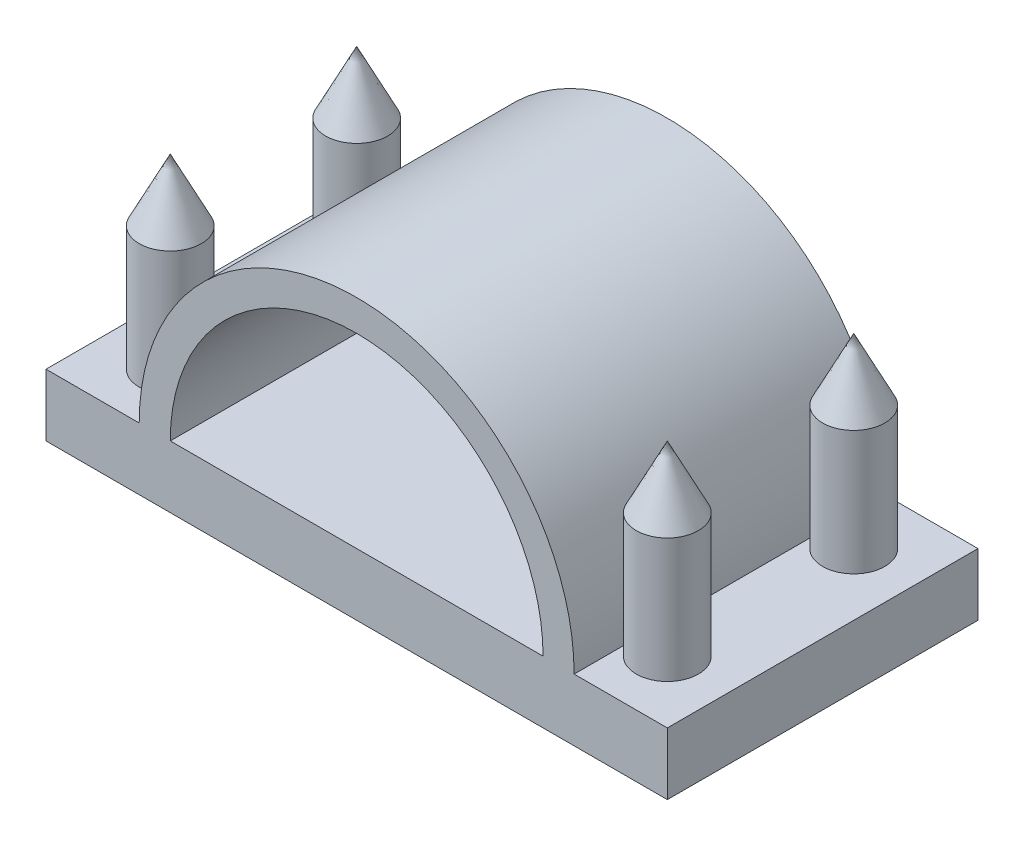
ISO-10303-21;
HEADER;
FILE_DESCRIPTION(('STEP AP214'),'2;1');
FILE_NAME('part.step','',(''),(''),'','','');
FILE_SCHEMA(('AUTOMOTIVE_DESIGN { 1 0 10303 214 1 1 1 1 }'));
ENDSEC;
DATA;
#1=APPLICATION_CONTEXT('core data for automotive mechanical design processes');
#2=APPLICATION_PROTOCOL_DEFINITION('international standard','automotive_design',2000,#1);
#3=PRODUCT_CONTEXT('',#1,'mechanical');
#4=PRODUCT('Part','Part','',(#3));
#5=PRODUCT_RELATED_PRODUCT_CATEGORY('part','',(#4));
#6=PRODUCT_DEFINITION_FORMATION('','',#4);
#7=PRODUCT_DEFINITION_CONTEXT('part definition',#1,'design');
#8=PRODUCT_DEFINITION('design','',#6,#7);
#9=PRODUCT_DEFINITION_SHAPE('','',#8);
#10=(LENGTH_UNIT() NAMED_UNIT(*) SI_UNIT(.MILLI.,.METRE.));
#11=(NAMED_UNIT(*) PLANE_ANGLE_UNIT() SI_UNIT($,.RADIAN.));
#12=(NAMED_UNIT(*) SI_UNIT($,.STERADIAN.) SOLID_ANGLE_UNIT());
#13=UNCERTAINTY_MEASURE_WITH_UNIT(LENGTH_MEASURE(1.E-05),#10,'distance_accuracy_value','');
#14=(GEOMETRIC_REPRESENTATION_CONTEXT(3) GLOBAL_UNCERTAINTY_ASSIGNED_CONTEXT((#13)) GLOBAL_UNIT_ASSIGNED_CONTEXT((#10,
#11,#12)) REPRESENTATION_CONTEXT('',''));
#15=CARTESIAN_POINT('',(0.,0.,0.));
#16=DIRECTION('',(0.,0.,1.));
#17=DIRECTION('',(1.,0.,0.));
#18=AXIS2_PLACEMENT_3D('',#15,#16,#17);
#19=CARTESIAN_POINT('',(0.,10.,0.));
#20=DIRECTION('',(0.,-1.,0.));
#21=DIRECTION('',(0.,0.,-1.));
#22=AXIS2_PLACEMENT_3D('',#19,#20,#21);
#23=PLANE('',#22);
#24=DIRECTION('',(0.,0.,1.));
#25=VECTOR('',#24,1.);
#26=CARTESIAN_POINT('',(35.,10.,-103.262379212493));
#27=LINE('',#26,#25);
#28=CARTESIAN_POINT('',(35.,10.,15.));
#29=VERTEX_POINT('',#28);
#30=CARTESIAN_POINT('',(35.,10.,25.));
#31=VERTEX_POINT('',#30);
#32=EDGE_CURVE('E145',#29,#31,#27,.T.);
#33=ORIENTED_EDGE('',*,*,#32,.T.);
#34=DIRECTION('',(1.,0.,0.));
#35=VECTOR('',#34,1.);
#36=CARTESIAN_POINT('',(50.,10.,25.));
#37=LINE('',#36,#35);
#38=CARTESIAN_POINT('',(50.,10.,25.));
#39=VERTEX_POINT('',#38);
#40=EDGE_CURVE('E190',#31,#39,#37,.T.);
#41=ORIENTED_EDGE('',*,*,#40,.T.);
#42=DIRECTION('',(0.,0.,-1.));
#43=VECTOR('',#42,1.);
#44=CARTESIAN_POINT('',(50.,10.,-25.));
#45=LINE('',#44,#43);
#46=CARTESIAN_POINT('',(50.,10.,-25.));
#47=VERTEX_POINT('',#46);
#48=EDGE_CURVE('E194',#39,#47,#45,.T.);
#49=ORIENTED_EDGE('',*,*,#48,.T.);
#50=DIRECTION('',(-1.,0.,0.));
#51=VECTOR('',#50,1.);
#52=CARTESIAN_POINT('',(50.,10.,-25.));
#53=LINE('',#52,#51);
#54=CARTESIAN_POINT('',(35.,10.,-25.));
#55=VERTEX_POINT('',#54);
#56=EDGE_CURVE('E66',#47,#55,#53,.T.);
#57=ORIENTED_EDGE('',*,*,#56,.T.);
#58=CARTESIAN_POINT('',(35.,10.,-15.));
#59=VERTEX_POINT('',#58);
#60=EDGE_CURVE('E169',#55,#59,#27,.T.);
#61=ORIENTED_EDGE('',*,*,#60,.T.);
#62=CARTESIAN_POINT('',(40.,10.,-15.));
#63=DIRECTION('',(0.,-1.,0.));
#64=DIRECTION('',(0.,0.,1.));
#65=AXIS2_PLACEMENT_3D('',#62,#63,#64);
#66=CIRCLE('',#65,5.);
#67=EDGE_CURVE('E154',#59,#59,#66,.T.);
#68=ORIENTED_EDGE('',*,*,#67,.T.);
#69=EDGE_CURVE('E170',#59,#29,#27,.T.);
#70=ORIENTED_EDGE('',*,*,#69,.T.);
#71=CARTESIAN_POINT('',(40.,10.,15.));
#72=DIRECTION('',(0.,-1.,0.));
#73=DIRECTION('',(0.,0.,-1.));
#74=AXIS2_PLACEMENT_3D('',#71,#72,#73);
#75=CIRCLE('',#74,5.);
#76=EDGE_CURVE('E51',#29,#29,#75,.F.);
#77=ORIENTED_EDGE('',*,*,#76,.F.);
#78=EDGE_LOOP('',(#33,#41,#49,#57,#61,#68,#70,#77));
#79=FACE_BOUND('',#78,.T.);
#80=ADVANCED_FACE('F43',(#79),#23,.F.);
#81=DIRECTION('',(0.,0.,1.));
#82=VECTOR('',#81,1.);
#83=CARTESIAN_POINT('',(-35.,10.,-103.262379212493));
#84=LINE('',#83,#82);
#85=CARTESIAN_POINT('',(-35.,10.,-25.));
#86=VERTEX_POINT('',#85);
#87=CARTESIAN_POINT('',(-35.,10.,-15.));
#88=VERTEX_POINT('',#87);
#89=EDGE_CURVE('E164',#86,#88,#84,.T.);
#90=ORIENTED_EDGE('',*,*,#89,.F.);
#91=CARTESIAN_POINT('',(-50.,10.,-25.));
#92=VERTEX_POINT('',#91);
#93=EDGE_CURVE('E135',#86,#92,#53,.T.);
#94=ORIENTED_EDGE('',*,*,#93,.T.);
#95=DIRECTION('',(0.,0.,1.));
#96=VECTOR('',#95,1.);
#97=CARTESIAN_POINT('',(-50.,10.,-25.));
#98=LINE('',#97,#96);
#99=CARTESIAN_POINT('',(-50.,10.,25.));
#100=VERTEX_POINT('',#99);
#101=EDGE_CURVE('E187',#92,#100,#98,.T.);
#102=ORIENTED_EDGE('',*,*,#101,.T.);
#103=CARTESIAN_POINT('',(-35.,10.,25.));
#104=VERTEX_POINT('',#103);
#105=EDGE_CURVE('E192',#100,#104,#37,.T.);
#106=ORIENTED_EDGE('',*,*,#105,.T.);
#107=CARTESIAN_POINT('',(-35.,10.,15.));
#108=VERTEX_POINT('',#107);
#109=EDGE_CURVE('E168',#108,#104,#84,.T.);
#110=ORIENTED_EDGE('',*,*,#109,.F.);
#111=CARTESIAN_POINT('',(-40.,10.,15.));
#112=DIRECTION('',(0.,-1.,0.));
#113=DIRECTION('',(0.,0.,-1.));
#114=AXIS2_PLACEMENT_3D('',#111,#112,#113);
#115=CIRCLE('',#114,5.);
#116=EDGE_CURVE('E183',#108,#108,#115,.T.);
#117=ORIENTED_EDGE('',*,*,#116,.T.);
#118=EDGE_CURVE('E167',#88,#108,#84,.T.);
#119=ORIENTED_EDGE('',*,*,#118,.F.);
#120=CARTESIAN_POINT('',(-40.,10.,-15.));
#121=DIRECTION('',(0.,-1.,0.));
#122=DIRECTION('',(0.,0.,-1.));
#123=AXIS2_PLACEMENT_3D('',#120,#121,#122);
#124=CIRCLE('',#123,5.);
#125=EDGE_CURVE('E12',#88,#88,#124,.F.);
#126=ORIENTED_EDGE('',*,*,#125,.F.);
#127=EDGE_LOOP('',(#90,#94,#102,#106,#110,#117,#119,#126));
#128=FACE_BOUND('',#127,.T.);
#129=ADVANCED_FACE('F257',(#128),#23,.F.);
#130=CARTESIAN_POINT('',(-50.,10.,-25.));
#131=DIRECTION('',(1.,0.,0.));
#132=DIRECTION('',(0.,0.,-1.));
#133=AXIS2_PLACEMENT_3D('',#130,#131,#132);
#134=PLANE('',#133);
#135=DIRECTION('',(0.,0.,1.));
#136=VECTOR('',#135,1.);
#137=CARTESIAN_POINT('',(-50.,0.,-25.));
#138=LINE('',#137,#136);
#139=CARTESIAN_POINT('',(-50.,0.,-25.));
#140=VERTEX_POINT('',#139);
#141=CARTESIAN_POINT('',(-50.,0.,25.));
#142=VERTEX_POINT('',#141);
#143=EDGE_CURVE('E186',#140,#142,#138,.T.);
#144=ORIENTED_EDGE('',*,*,#143,.T.);
#145=DIRECTION('',(0.,-1.,0.));
#146=VECTOR('',#145,1.);
#147=CARTESIAN_POINT('',(-50.,10.,25.));
#148=LINE('',#147,#146);
#149=EDGE_CURVE('E212',#100,#142,#148,.T.);
#150=ORIENTED_EDGE('',*,*,#149,.F.);
#151=ORIENTED_EDGE('',*,*,#101,.F.);
#152=DIRECTION('',(0.,-1.,0.));
#153=VECTOR('',#152,1.);
#154=CARTESIAN_POINT('',(-50.,10.,-25.));
#155=LINE('',#154,#153);
#156=EDGE_CURVE('E196',#92,#140,#155,.T.);
#157=ORIENTED_EDGE('',*,*,#156,.T.);
#158=EDGE_LOOP('',(#144,#150,#151,#157));
#159=FACE_BOUND('',#158,.T.);
#160=ADVANCED_FACE('F45',(#159),#134,.F.);
#161=CARTESIAN_POINT('',(50.,10.,25.));
#162=DIRECTION('',(0.,0.,-1.));
#163=DIRECTION('',(-1.,0.,0.));
#164=AXIS2_PLACEMENT_3D('',#161,#162,#163);
#165=PLANE('',#164);
#166=CARTESIAN_POINT('',(-30.,10.,25.));
#167=VERTEX_POINT('',#166);
#168=CARTESIAN_POINT('',(30.,10.,25.));
#169=VERTEX_POINT('',#168);
#170=EDGE_CURVE('E141',#167,#169,#37,.T.);
#171=ORIENTED_EDGE('',*,*,#170,.F.);
#172=CARTESIAN_POINT('',(0.,10.,25.));
#173=DIRECTION('',(0.,0.,-1.));
#174=DIRECTION('',(-1.,0.,0.));
#175=AXIS2_PLACEMENT_3D('',#172,#173,#174);
#176=CIRCLE('',#175,30.);
#177=EDGE_CURVE('E159',#167,#169,#176,.T.);
#178=ORIENTED_EDGE('',*,*,#177,.T.);
#179=EDGE_LOOP('',(#171,#178));
#180=FACE_BOUND('',#179,.T.);
#181=DIRECTION('',(1.,0.,0.));
#182=VECTOR('',#181,1.);
#183=CARTESIAN_POINT('',(50.,0.,25.));
#184=LINE('',#183,#182);
#185=CARTESIAN_POINT('',(50.,0.,25.));
#186=VERTEX_POINT('',#185);
#187=EDGE_CURVE('E199',#142,#186,#184,.T.);
#188=ORIENTED_EDGE('',*,*,#187,.T.);
#189=DIRECTION('',(0.,-1.,0.));
#190=VECTOR('',#189,1.);
#191=CARTESIAN_POINT('',(50.,10.,25.));
#192=LINE('',#191,#190);
#193=EDGE_CURVE('E209',#39,#186,#192,.T.);
#194=ORIENTED_EDGE('',*,*,#193,.F.);
#195=ORIENTED_EDGE('',*,*,#40,.F.);
#196=CARTESIAN_POINT('',(0.,10.,25.));
#197=DIRECTION('',(0.,0.,-1.));
#198=DIRECTION('',(-1.,0.,0.));
#199=AXIS2_PLACEMENT_3D('',#196,#197,#198);
#200=CIRCLE('',#199,35.);
#201=EDGE_CURVE('E146',#104,#31,#200,.T.);
#202=ORIENTED_EDGE('',*,*,#201,.F.);
#203=ORIENTED_EDGE('',*,*,#105,.F.);
#204=ORIENTED_EDGE('',*,*,#149,.T.);
#205=EDGE_LOOP('',(#188,#194,#195,#202,#203,#204));
#206=FACE_BOUND('',#205,.T.);
#207=ADVANCED_FACE('F228',(#180,#206),#165,.F.);
#208=CARTESIAN_POINT('',(50.,10.,-25.));
#209=DIRECTION('',(-1.,0.,0.));
#210=DIRECTION('',(0.,0.,1.));
#211=AXIS2_PLACEMENT_3D('',#208,#209,#210);
#212=PLANE('',#211);
#213=DIRECTION('',(0.,0.,-1.));
#214=VECTOR('',#213,1.);
#215=CARTESIAN_POINT('',(50.,0.,-25.));
#216=LINE('',#215,#214);
#217=CARTESIAN_POINT('',(50.,0.,-25.));
#218=VERTEX_POINT('',#217);
#219=EDGE_CURVE('E201',#186,#218,#216,.T.);
#220=ORIENTED_EDGE('',*,*,#219,.T.);
#221=DIRECTION('',(0.,-1.,0.));
#222=VECTOR('',#221,1.);
#223=CARTESIAN_POINT('',(50.,10.,-25.));
#224=LINE('',#223,#222);
#225=EDGE_CURVE('E206',#47,#218,#224,.T.);
#226=ORIENTED_EDGE('',*,*,#225,.F.);
#227=ORIENTED_EDGE('',*,*,#48,.F.);
#228=ORIENTED_EDGE('',*,*,#193,.T.);
#229=EDGE_LOOP('',(#220,#226,#227,#228));
#230=FACE_BOUND('',#229,.T.);
#231=ADVANCED_FACE('F233',(#230),#212,.F.);
#232=CARTESIAN_POINT('',(50.,10.,-25.));
#233=DIRECTION('',(0.,0.,1.));
#234=DIRECTION('',(1.,0.,0.));
#235=AXIS2_PLACEMENT_3D('',#232,#233,#234);
#236=PLANE('',#235);
#237=CARTESIAN_POINT('',(30.,10.,-25.));
#238=VERTEX_POINT('',#237);
#239=CARTESIAN_POINT('',(-30.,10.,-25.));
#240=VERTEX_POINT('',#239);
#241=EDGE_CURVE('E58',#238,#240,#53,.T.);
#242=ORIENTED_EDGE('',*,*,#241,.F.);
#243=CARTESIAN_POINT('',(0.,10.,-25.));
#244=DIRECTION('',(0.,0.,1.));
#245=DIRECTION('',(1.,0.,0.));
#246=AXIS2_PLACEMENT_3D('',#243,#244,#245);
#247=CIRCLE('',#246,30.);
#248=EDGE_CURVE('E133',#238,#240,#247,.T.);
#249=ORIENTED_EDGE('',*,*,#248,.T.);
#250=EDGE_LOOP('',(#242,#249));
#251=FACE_BOUND('',#250,.T.);
#252=DIRECTION('',(-1.,0.,0.));
#253=VECTOR('',#252,1.);
#254=CARTESIAN_POINT('',(50.,0.,-25.));
#255=LINE('',#254,#253);
#256=EDGE_CURVE('E191',#218,#140,#255,.T.);
#257=ORIENTED_EDGE('',*,*,#256,.T.);
#258=ORIENTED_EDGE('',*,*,#156,.F.);
#259=ORIENTED_EDGE('',*,*,#93,.F.);
#260=CARTESIAN_POINT('',(0.,10.,-25.));
#261=DIRECTION('',(0.,0.,1.));
#262=DIRECTION('',(1.,0.,0.));
#263=AXIS2_PLACEMENT_3D('',#260,#261,#262);
#264=CIRCLE('',#263,35.);
#265=EDGE_CURVE('E151',#55,#86,#264,.T.);
#266=ORIENTED_EDGE('',*,*,#265,.F.);
#267=ORIENTED_EDGE('',*,*,#56,.F.);
#268=ORIENTED_EDGE('',*,*,#225,.T.);
#269=EDGE_LOOP('',(#257,#258,#259,#266,#267,#268));
#270=FACE_BOUND('',#269,.T.);
#271=ADVANCED_FACE('F130',(#251,#270),#236,.F.);
#272=ORIENTED_EDGE('',*,*,#170,.T.);
#273=DIRECTION('',(0.,0.,1.));
#274=VECTOR('',#273,1.);
#275=CARTESIAN_POINT('',(30.,10.,-103.262379212493));
#276=LINE('',#275,#274);
#277=EDGE_CURVE('E138',#238,#169,#276,.T.);
#278=ORIENTED_EDGE('',*,*,#277,.F.);
#279=ORIENTED_EDGE('',*,*,#241,.T.);
#280=DIRECTION('',(0.,0.,1.));
#281=VECTOR('',#280,1.);
#282=CARTESIAN_POINT('',(-30.,10.,-103.262379212493));
#283=LINE('',#282,#281);
#284=EDGE_CURVE('E149',#240,#167,#283,.T.);
#285=ORIENTED_EDGE('',*,*,#284,.T.);
#286=EDGE_LOOP('',(#272,#278,#279,#285));
#287=FACE_BOUND('',#286,.T.);
#288=ADVANCED_FACE('F139',(#287),#23,.F.);
#289=CARTESIAN_POINT('',(0.,0.,0.));
#290=DIRECTION('',(0.,-1.,0.));
#291=DIRECTION('',(0.,0.,-1.));
#292=AXIS2_PLACEMENT_3D('',#289,#290,#291);
#293=PLANE('',#292);
#294=ORIENTED_EDGE('',*,*,#143,.F.);
#295=ORIENTED_EDGE('',*,*,#256,.F.);
#296=ORIENTED_EDGE('',*,*,#219,.F.);
#297=ORIENTED_EDGE('',*,*,#187,.F.);
#298=EDGE_LOOP('',(#294,#295,#296,#297));
#299=FACE_BOUND('',#298,.T.);
#300=ADVANCED_FACE('F266',(#299),#293,.T.);
#301=CARTESIAN_POINT('',(-40.,30.,15.));
#302=DIRECTION('',(0.,-1.,0.));
#303=DIRECTION('',(0.,0.,-1.));
#304=AXIS2_PLACEMENT_3D('',#301,#302,#303);
#305=CYLINDRICAL_SURFACE('',#304,5.);
#306=CARTESIAN_POINT('',(-40.,30.,15.));
#307=DIRECTION('',(0.,-1.,0.));
#308=DIRECTION('',(0.,0.,-1.));
#309=AXIS2_PLACEMENT_3D('',#306,#307,#308);
#310=CIRCLE('',#309,5.);
#311=CARTESIAN_POINT('',(-40.,30.,9.99999999999999));
#312=VERTEX_POINT('',#311);
#313=EDGE_CURVE('E180',#312,#312,#310,.T.);
#314=ORIENTED_EDGE('',*,*,#313,.T.);
#315=EDGE_LOOP('',(#314));
#316=FACE_BOUND('',#315,.T.);
#317=ORIENTED_EDGE('',*,*,#116,.F.);
#318=EDGE_LOOP('',(#317));
#319=FACE_BOUND('',#318,.T.);
#320=ADVANCED_FACE('F271',(#316,#319),#305,.T.);
#321=CARTESIAN_POINT('',(-40.,40.,15.));
#322=DIRECTION('',(0.,-1.,0.));
#323=DIRECTION('',(0.,0.,-1.));
#324=AXIS2_PLACEMENT_3D('',#321,#322,#323);
#325=CONICAL_SURFACE('',#324,0.,0.463647609000806);
#326=ORIENTED_EDGE('',*,*,#313,.F.);
#327=EDGE_LOOP('',(#326));
#328=FACE_BOUND('',#327,.T.);
#329=CARTESIAN_POINT('',(-40.,40.,15.));
#330=VERTEX_POINT('',#329);
#331=VERTEX_LOOP('',#330);
#332=FACE_BOUND('',#331,.T.);
#333=ADVANCED_FACE('F294',(#328,#332),#325,.T.);
#334=CARTESIAN_POINT('',(40.,30.,15.));
#335=DIRECTION('',(0.,-1.,0.));
#336=DIRECTION('',(0.,0.,-1.));
#337=AXIS2_PLACEMENT_3D('',#334,#335,#336);
#338=CYLINDRICAL_SURFACE('',#337,5.);
#339=CARTESIAN_POINT('',(40.,30.,15.));
#340=DIRECTION('',(0.,1.,0.));
#341=DIRECTION('',(0.,0.,-1.));
#342=AXIS2_PLACEMENT_3D('',#339,#340,#341);
#343=CIRCLE('',#342,5.);
#344=CARTESIAN_POINT('',(40.,30.,9.99999999999999));
#345=VERTEX_POINT('',#344);
#346=EDGE_CURVE('E177',#345,#345,#343,.T.);
#347=ORIENTED_EDGE('',*,*,#346,.F.);
#348=EDGE_LOOP('',(#347));
#349=FACE_BOUND('',#348,.T.);
#350=ORIENTED_EDGE('',*,*,#76,.T.);
#351=EDGE_LOOP('',(#350));
#352=FACE_BOUND('',#351,.T.);
#353=ADVANCED_FACE('F217',(#349,#352),#338,.T.);
#354=CARTESIAN_POINT('',(40.,40.,15.));
#355=DIRECTION('',(0.,-1.,0.));
#356=DIRECTION('',(0.,0.,-1.));
#357=AXIS2_PLACEMENT_3D('',#354,#355,#356);
#358=CONICAL_SURFACE('',#357,0.,0.463647609000806);
#359=ORIENTED_EDGE('',*,*,#346,.T.);
#360=EDGE_LOOP('',(#359));
#361=FACE_BOUND('',#360,.T.);
#362=CARTESIAN_POINT('',(40.,40.,15.));
#363=VERTEX_POINT('',#362);
#364=VERTEX_LOOP('',#363);
#365=FACE_BOUND('',#364,.T.);
#366=ADVANCED_FACE('F253',(#361,#365),#358,.T.);
#367=CARTESIAN_POINT('',(-40.,30.,-15.));
#368=DIRECTION('',(0.,-1.,0.));
#369=DIRECTION('',(0.,0.,-1.));
#370=AXIS2_PLACEMENT_3D('',#367,#368,#369);
#371=CYLINDRICAL_SURFACE('',#370,5.);
#372=CARTESIAN_POINT('',(-40.,30.,-15.));
#373=DIRECTION('',(0.,1.,0.));
#374=DIRECTION('',(0.,0.,1.));
#375=AXIS2_PLACEMENT_3D('',#372,#373,#374);
#376=CIRCLE('',#375,5.);
#377=CARTESIAN_POINT('',(-40.,30.,-9.99999999999999));
#378=VERTEX_POINT('',#377);
#379=EDGE_CURVE('E174',#378,#378,#376,.T.);
#380=ORIENTED_EDGE('',*,*,#379,.F.);
#381=EDGE_LOOP('',(#380));
#382=FACE_BOUND('',#381,.T.);
#383=ORIENTED_EDGE('',*,*,#125,.T.);
#384=EDGE_LOOP('',(#383));
#385=FACE_BOUND('',#384,.T.);
#386=ADVANCED_FACE('F243',(#382,#385),#371,.T.);
#387=CARTESIAN_POINT('',(40.,30.,-15.));
#388=DIRECTION('',(0.,-1.,0.));
#389=DIRECTION('',(0.,0.,-1.));
#390=AXIS2_PLACEMENT_3D('',#387,#388,#389);
#391=CYLINDRICAL_SURFACE('',#390,5.);
#392=CARTESIAN_POINT('',(40.,30.,-15.));
#393=DIRECTION('',(0.,-1.,0.));
#394=DIRECTION('',(0.,0.,1.));
#395=AXIS2_PLACEMENT_3D('',#392,#393,#394);
#396=CIRCLE('',#395,5.);
#397=CARTESIAN_POINT('',(40.,30.,-9.99999999999999));
#398=VERTEX_POINT('',#397);
#399=EDGE_CURVE('E150',#398,#398,#396,.T.);
#400=ORIENTED_EDGE('',*,*,#399,.T.);
#401=EDGE_LOOP('',(#400));
#402=FACE_BOUND('',#401,.T.);
#403=ORIENTED_EDGE('',*,*,#67,.F.);
#404=EDGE_LOOP('',(#403));
#405=FACE_BOUND('',#404,.T.);
#406=ADVANCED_FACE('F240',(#402,#405),#391,.T.);
#407=CARTESIAN_POINT('',(-40.,40.,-15.));
#408=DIRECTION('',(0.,-1.,0.));
#409=DIRECTION('',(0.,0.,-1.));
#410=AXIS2_PLACEMENT_3D('',#407,#408,#409);
#411=CONICAL_SURFACE('',#410,0.,0.463647609000806);
#412=ORIENTED_EDGE('',*,*,#379,.T.);
#413=EDGE_LOOP('',(#412));
#414=FACE_BOUND('',#413,.T.);
#415=CARTESIAN_POINT('',(-40.,40.,-15.));
#416=VERTEX_POINT('',#415);
#417=VERTEX_LOOP('',#416);
#418=FACE_BOUND('',#417,.T.);
#419=ADVANCED_FACE('F242',(#414,#418),#411,.T.);
#420=CARTESIAN_POINT('',(40.,40.,-15.));
#421=DIRECTION('',(0.,-1.,0.));
#422=DIRECTION('',(0.,0.,-1.));
#423=AXIS2_PLACEMENT_3D('',#420,#421,#422);
#424=CONICAL_SURFACE('',#423,0.,0.463647609000806);
#425=ORIENTED_EDGE('',*,*,#399,.F.);
#426=EDGE_LOOP('',(#425));
#427=FACE_BOUND('',#426,.T.);
#428=CARTESIAN_POINT('',(40.,40.,-15.));
#429=VERTEX_POINT('',#428);
#430=VERTEX_LOOP('',#429);
#431=FACE_BOUND('',#430,.T.);
#432=ADVANCED_FACE('F250',(#427,#431),#424,.T.);
#433=CARTESIAN_POINT('',(0.,10.,-103.262379212493));
#434=DIRECTION('',(0.,0.,1.));
#435=DIRECTION('',(1.,0.,0.));
#436=AXIS2_PLACEMENT_3D('',#433,#434,#435);
#437=CYLINDRICAL_SURFACE('',#436,30.);
#438=ORIENTED_EDGE('',*,*,#248,.F.);
#439=ORIENTED_EDGE('',*,*,#277,.T.);
#440=ORIENTED_EDGE('',*,*,#177,.F.);
#441=ORIENTED_EDGE('',*,*,#284,.F.);
#442=EDGE_LOOP('',(#438,#439,#440,#441));
#443=FACE_BOUND('',#442,.T.);
#444=ADVANCED_FACE('F148',(#443),#437,.F.);
#445=CARTESIAN_POINT('',(0.,10.,-103.262379212493));
#446=DIRECTION('',(0.,0.,1.));
#447=DIRECTION('',(1.,0.,0.));
#448=AXIS2_PLACEMENT_3D('',#445,#446,#447);
#449=CYLINDRICAL_SURFACE('',#448,35.);
#450=ORIENTED_EDGE('',*,*,#60,.F.);
#451=ORIENTED_EDGE('',*,*,#265,.T.);
#452=ORIENTED_EDGE('',*,*,#89,.T.);
#453=ORIENTED_EDGE('',*,*,#118,.T.);
#454=ORIENTED_EDGE('',*,*,#109,.T.);
#455=ORIENTED_EDGE('',*,*,#201,.T.);
#456=ORIENTED_EDGE('',*,*,#32,.F.);
#457=ORIENTED_EDGE('',*,*,#69,.F.);
#458=EDGE_LOOP('',(#450,#451,#452,#453,#454,#455,#456,#457));
#459=FACE_BOUND('',#458,.T.);
#460=ADVANCED_FACE('F223',(#459),#449,.T.);
#461=CLOSED_SHELL('',(#80,#129,#160,#207,#231,#271,#288,#300,#320,#333,#353,#366,#386,#406,#419,
#432,#444,#460));
#462=MANIFOLD_SOLID_BREP('B2',#461);
#463=ADVANCED_BREP_SHAPE_REPRESENTATION('',(#18,#462),#14);
#464=SHAPE_DEFINITION_REPRESENTATION(#9,#463);
ENDSEC;
END-ISO-10303-21;
